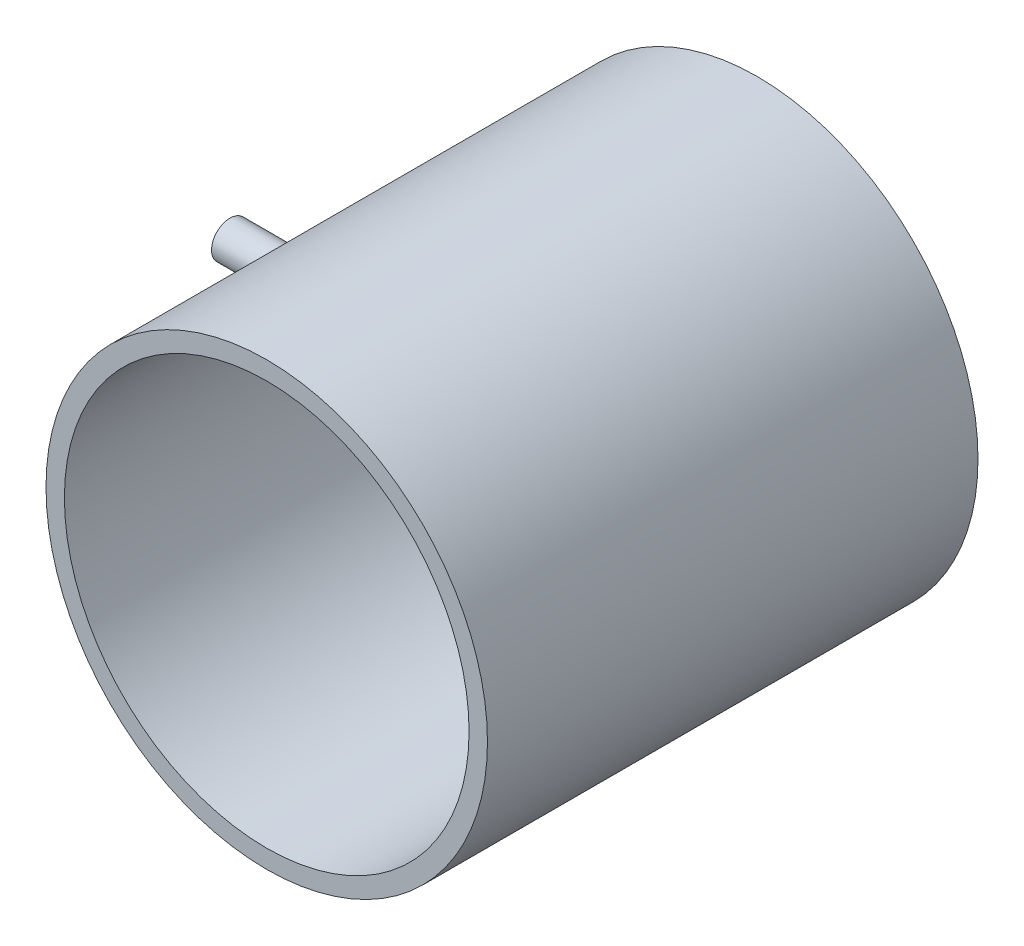
ISO-10303-21;
HEADER;
FILE_DESCRIPTION(('STEP AP214'),'2;1');
FILE_NAME('part.step','',(''),(''),'','','');
FILE_SCHEMA(('AUTOMOTIVE_DESIGN { 1 0 10303 214 1 1 1 1 }'));
ENDSEC;
DATA;
#1=APPLICATION_CONTEXT('core data for automotive mechanical design processes');
#2=APPLICATION_PROTOCOL_DEFINITION('international standard','automotive_design',2000,#1);
#3=PRODUCT_CONTEXT('',#1,'mechanical');
#4=PRODUCT('Part','Part','',(#3));
#5=PRODUCT_RELATED_PRODUCT_CATEGORY('part','',(#4));
#6=PRODUCT_DEFINITION_FORMATION('','',#4);
#7=PRODUCT_DEFINITION_CONTEXT('part definition',#1,'design');
#8=PRODUCT_DEFINITION('design','',#6,#7);
#9=PRODUCT_DEFINITION_SHAPE('','',#8);
#10=(LENGTH_UNIT() NAMED_UNIT(*) SI_UNIT(.MILLI.,.METRE.));
#11=(NAMED_UNIT(*) PLANE_ANGLE_UNIT() SI_UNIT($,.RADIAN.));
#12=(NAMED_UNIT(*) SI_UNIT($,.STERADIAN.) SOLID_ANGLE_UNIT());
#13=UNCERTAINTY_MEASURE_WITH_UNIT(LENGTH_MEASURE(1.E-05),#10,'distance_accuracy_value','');
#14=(GEOMETRIC_REPRESENTATION_CONTEXT(3) GLOBAL_UNCERTAINTY_ASSIGNED_CONTEXT((#13)) GLOBAL_UNIT_ASSIGNED_CONTEXT((#10,
#11,#12)) REPRESENTATION_CONTEXT('',''));
#15=CARTESIAN_POINT('',(0.,0.,0.));
#16=DIRECTION('',(0.,0.,1.));
#17=DIRECTION('',(1.,0.,0.));
#18=AXIS2_PLACEMENT_3D('',#15,#16,#17);
#19=CARTESIAN_POINT('',(-37.1412967530773,71.0530422397824,-40.));
#20=DIRECTION('',(0.,0.,1.));
#21=DIRECTION('',(1.,0.,0.));
#22=AXIS2_PLACEMENT_3D('',#19,#20,#21);
#23=CYLINDRICAL_SURFACE('',#22,18.);
#24=CARTESIAN_POINT('',(-37.1412967530773,71.0530422397824,0.));
#25=DIRECTION('',(0.,0.,1.));
#26=DIRECTION('',(1.,0.,0.));
#27=AXIS2_PLACEMENT_3D('',#24,#25,#26);
#28=CIRCLE('',#27,18.);
#29=CARTESIAN_POINT('',(-19.1412967530773,71.0530422397824,0.));
#30=VERTEX_POINT('',#29);
#31=EDGE_CURVE('E33',#30,#30,#28,.T.);
#32=ORIENTED_EDGE('',*,*,#31,.F.);
#33=EDGE_LOOP('',(#32));
#34=FACE_BOUND('',#33,.T.);
#35=CARTESIAN_POINT('',(-37.1412967530773,71.0530422397824,-40.));
#36=DIRECTION('',(0.,0.,1.));
#37=DIRECTION('',(1.,0.,0.));
#38=AXIS2_PLACEMENT_3D('',#35,#36,#37);
#39=CIRCLE('',#38,18.);
#40=CARTESIAN_POINT('',(-19.1412967530773,71.0530422397824,-40.));
#41=VERTEX_POINT('',#40);
#42=EDGE_CURVE('E10',#41,#41,#39,.T.);
#43=ORIENTED_EDGE('',*,*,#42,.T.);
#44=EDGE_LOOP('',(#43));
#45=FACE_BOUND('',#44,.T.);
#46=CARTESIAN_POINT('',(-55.1412967530773,71.0530422397824,-23.5));
#47=CARTESIAN_POINT('',(-55.1412959342501,70.9689431049006,-23.5000036732394));
#48=CARTESIAN_POINT('',(-55.1407010812283,70.884786719012,-23.5070964547166));
#49=CARTESIAN_POINT('',(-55.1383852880011,70.7188023837318,-23.5352865277826));
#50=CARTESIAN_POINT('',(-55.1366630720527,70.6369771819445,-23.5563996854574));
#51=CARTESIAN_POINT('',(-55.1322871717689,70.478083206011,-23.6120157307141));
#52=CARTESIAN_POINT('',(-55.1296340145546,70.4010117691455,-23.6465110421647));
#53=CARTESIAN_POINT('',(-55.123693769248,70.2537713896583,-23.727898647808));
#54=CARTESIAN_POINT('',(-55.1204068167977,70.1836009749543,-23.7747882902163));
#55=CARTESIAN_POINT('',(-55.113558451078,70.051957239834,-23.879762599909));
#56=CARTESIAN_POINT('',(-55.109996434376,69.9905039311581,-23.9378723259035));
#57=CARTESIAN_POINT('',(-55.1030044651248,69.8782105394775,-24.0635843437749));
#58=CARTESIAN_POINT('',(-55.0995745183829,69.8273709227251,-24.1311870524539));
#59=CARTESIAN_POINT('',(-55.093228542996,69.737680356197,-24.2740871756485));
#60=CARTESIAN_POINT('',(-55.0903132707787,69.6988469903551,-24.3493956631042));
#61=CARTESIAN_POINT('',(-55.0853336198014,69.6343835891216,-24.505492443334));
#62=CARTESIAN_POINT('',(-55.0832692260118,69.6087533205138,-24.5862806392874));
#63=CARTESIAN_POINT('',(-55.0802301340721,69.5714816950545,-24.7508430878218));
#64=CARTESIAN_POINT('',(-55.0792528971206,69.5598077416977,-24.8346099099889));
#65=CARTESIAN_POINT('',(-55.0784907378995,69.5506794277592,-25.002919305918));
#66=CARTESIAN_POINT('',(-55.0787057932532,69.5532248003131,-25.0874618650915));
#67=CARTESIAN_POINT('',(-55.0803016135019,69.5724359434601,-25.2546994982658));
#68=CARTESIAN_POINT('',(-55.0816794537451,69.5890662877253,-25.3373986736146));
#69=CARTESIAN_POINT('',(-55.0854410066178,69.635920261708,-25.4988278010894));
#70=CARTESIAN_POINT('',(-55.0878247290713,69.6661440241872,-25.5775577144408));
#71=CARTESIAN_POINT('',(-55.0933328236801,69.7393665575543,-25.7289263588171));
#72=CARTESIAN_POINT('',(-55.0964581163418,69.7823812226466,-25.8015573663813));
#73=CARTESIAN_POINT('',(-55.1030963560355,69.8799530739123,-25.9385820082297));
#74=CARTESIAN_POINT('',(-55.1066093109178,69.9345104938486,-26.0029754756458));
#75=CARTESIAN_POINT('',(-55.113640059252,70.0538178664428,-26.1219031289223));
#76=CARTESIAN_POINT('',(-55.1171578347033,70.1185984456965,-26.1764065961939));
#77=CARTESIAN_POINT('',(-55.1237916311248,70.2564064052247,-26.2737695850828));
#78=CARTESIAN_POINT('',(-55.1269076518266,70.3294337910094,-26.3166290989203));
#79=CARTESIAN_POINT('',(-55.1323874402219,70.4816823498806,-26.3894856440031));
#80=CARTESIAN_POINT('',(-55.134751128339,70.5609041770687,-26.4194813147172));
#81=CARTESIAN_POINT('',(-55.1384590142543,70.723283636253,-26.465737198677));
#82=CARTESIAN_POINT('',(-55.1398032332106,70.8064411865291,-26.4819976969829));
#83=CARTESIAN_POINT('',(-55.1413180072231,70.974065289536,-26.5002831460624));
#84=CARTESIAN_POINT('',(-55.1414920604573,71.0585271834552,-26.5023505271604));
#85=CARTESIAN_POINT('',(-55.1406562347578,71.2265963685373,-26.492302209059));
#86=CARTESIAN_POINT('',(-55.1396463668674,71.3102036676645,-26.4801866421558));
#87=CARTESIAN_POINT('',(-55.1365585206971,71.4740693741194,-26.4421515120849));
#88=CARTESIAN_POINT('',(-55.1344820643386,71.5543323774919,-26.4162516159613));
#89=CARTESIAN_POINT('',(-55.1294943047626,71.7093734874061,-26.351403118327));
#90=CARTESIAN_POINT('',(-55.1265829883459,71.7841515072071,-26.3124543105123));
#91=CARTESIAN_POINT('',(-55.1202431489818,71.9262930672352,-26.2225069761755));
#92=CARTESIAN_POINT('',(-55.1168134263584,71.9936387655646,-26.1714803404078));
#93=CARTESIAN_POINT('',(-55.1098261326728,72.1188238820478,-26.0588664144243));
#94=CARTESIAN_POINT('',(-55.1062685593902,72.1766631350039,-25.9972789407261));
#95=CARTESIAN_POINT('',(-55.0994161713146,72.281339057965,-25.8651074617025));
#96=CARTESIAN_POINT('',(-55.0961220311907,72.3281480396328,-25.7945014882039));
#97=CARTESIAN_POINT('',(-55.0901790292421,72.4092448340416,-25.6464066057049));
#98=CARTESIAN_POINT('',(-55.0875301609751,72.4435327717973,-25.5689177654351));
#99=CARTESIAN_POINT('',(-55.0831813958114,72.4985670059432,-25.4093548141912));
#100=CARTESIAN_POINT('',(-55.0814803115068,72.5193302519563,-25.3272865829285));
#101=CARTESIAN_POINT('',(-55.0792157384401,72.5467808946476,-25.1608139501884));
#102=CARTESIAN_POINT('',(-55.0786522278318,72.5534685616348,-25.0764095936056));
#103=CARTESIAN_POINT('',(-55.0787269223302,72.5525750841188,-24.9079358109687));
#104=CARTESIAN_POINT('',(-55.0793614634733,72.5450374444485,-24.8238661491454));
#105=CARTESIAN_POINT('',(-55.0817529793119,72.5159980347249,-24.6581911996737));
#106=CARTESIAN_POINT('',(-55.0835099557193,72.4944962433738,-24.5765859157842));
#107=CARTESIAN_POINT('',(-55.0879474100529,72.438149904808,-24.4181533551001));
#108=CARTESIAN_POINT('',(-55.0906278337702,72.4033061407922,-24.3413257981515));
#109=CARTESIAN_POINT('',(-55.0966102512034,72.3212698282033,-24.1946037391395));
#110=CARTESIAN_POINT('',(-55.099912235163,72.2740774734542,-24.12470912828));
#111=CARTESIAN_POINT('',(-55.1067777285575,72.168520152966,-23.9936143914805));
#112=CARTESIAN_POINT('',(-55.1103419731635,72.1101229803946,-23.932440237014));
#113=CARTESIAN_POINT('',(-55.1173236782225,71.9838720781711,-23.820737222195));
#114=CARTESIAN_POINT('',(-55.1207411029497,71.916016063744,-23.770210941256));
#115=CARTESIAN_POINT('',(-55.1270502757114,71.7726428993265,-23.6811702093737));
#116=CARTESIAN_POINT('',(-55.1299410334239,71.6971117241882,-23.6426782920155));
#117=CARTESIAN_POINT('',(-55.1348595408218,71.540685867776,-23.5789722954231));
#118=CARTESIAN_POINT('',(-55.1368882820012,71.4597974729029,-23.5537429535679));
#119=CARTESIAN_POINT('',(-55.1393333690851,71.3242003119274,-23.5237036262469));
#120=CARTESIAN_POINT('',(-55.1400662862316,71.2703635814401,-23.5148265812238));
#121=CARTESIAN_POINT('',(-55.1410482429568,71.1620399970341,-23.5029735854842));
#122=CARTESIAN_POINT('',(-55.1412972838202,71.1075531448419,-23.4999976191003));
#123=CARTESIAN_POINT('',(-55.1412967530773,71.0530422397824,-23.5));
#124=B_SPLINE_CURVE_WITH_KNOTS('',3,(#46,#47,#48,#49,#50,#51,#52,#53,#54,#55,#56,#57,#58,#59,
#60,#61,#62,#63,#64,#65,#66,#67,#68,#69,#70,#71,#72,#73,#74,#75,#76,#77,#78,#79,#80,#81,#82,#83,
#84,#85,#86,#87,#88,#89,#90,#91,#92,#93,#94,#95,#96,#97,#98,#99,#100,#101,#102,#103,#104,#105,
#106,#107,#108,#109,#110,#111,#112,#113,#114,#115,#116,#117,#118,#119,#120,#121,#122,#123),
.UNSPECIFIED.,.T.,.F.,(4,2,2,2,2,2,2,2,2,2,2,2,2,2,2,2,2,2,2,2,2,2,2,2,2,2,2,2,2,2,2,2,2,2,2,2,
2,2,4),(0.,0.252098380200205,0.504482533496747,0.756724010833428,1.00891156437625,
1.26166900317863,1.51443754310896,1.76757454426636,2.02070707391851,2.27324722247378,
2.52578263143927,2.77768474665432,3.02958932215497,3.28180823623348,3.5340322587129,
3.78702676402723,4.04002143837965,4.29304286385674,4.54605903798801,4.79831848960751,
5.0505755882133,5.30247373546177,5.55437586542058,5.8068701246239,6.05936877106874,
6.31249464736801,6.5656179962974,6.8184235086139,7.07122416598135,7.3232529432379,
7.57528210488508,7.82729647421282,8.07930688814782,8.33205282996957,8.58485992848719,
8.83813759593829,9.09112314887675,9.25452729534992,9.41793100798118),.UNSPECIFIED.);
#125=CARTESIAN_POINT('',(-55.1412967530773,71.0530422397824,-23.5));
#126=VERTEX_POINT('',#125);
#127=EDGE_CURVE('E50',#126,#126,#124,.T.);
#128=ORIENTED_EDGE('',*,*,#127,.T.);
#129=EDGE_LOOP('',(#128));
#130=FACE_BOUND('',#129,.T.);
#131=ADVANCED_FACE('F30',(#34,#45,#130),#23,.T.);
#132=CARTESIAN_POINT('',(-37.1412967530773,71.0530422397824,-40.));
#133=DIRECTION('',(0.,0.,1.));
#134=DIRECTION('',(1.,0.,0.));
#135=AXIS2_PLACEMENT_3D('',#132,#133,#134);
#136=PLANE('',#135);
#137=CARTESIAN_POINT('',(-37.1412967530773,71.0530422397824,-40.));
#138=DIRECTION('',(0.,0.,1.));
#139=DIRECTION('',(1.,0.,0.));
#140=AXIS2_PLACEMENT_3D('',#137,#138,#139);
#141=CIRCLE('',#140,16.5);
#142=CARTESIAN_POINT('',(-20.6412967530773,71.0530422397824,-40.));
#143=VERTEX_POINT('',#142);
#144=EDGE_CURVE('E40',#143,#143,#141,.T.);
#145=ORIENTED_EDGE('',*,*,#144,.T.);
#146=EDGE_LOOP('',(#145));
#147=FACE_BOUND('',#146,.T.);
#148=ORIENTED_EDGE('',*,*,#42,.F.);
#149=EDGE_LOOP('',(#148));
#150=FACE_BOUND('',#149,.T.);
#151=ADVANCED_FACE('F72',(#147,#150),#136,.F.);
#152=CARTESIAN_POINT('',(-37.1412967530773,71.0530422397824,0.));
#153=DIRECTION('',(0.,0.,1.));
#154=DIRECTION('',(1.,0.,0.));
#155=AXIS2_PLACEMENT_3D('',#152,#153,#154);
#156=PLANE('',#155);
#157=CARTESIAN_POINT('',(-37.1412967530773,71.0530422397824,0.));
#158=DIRECTION('',(0.,0.,1.));
#159=DIRECTION('',(1.,0.,0.));
#160=AXIS2_PLACEMENT_3D('',#157,#158,#159);
#161=CIRCLE('',#160,16.5);
#162=CARTESIAN_POINT('',(-20.6412967530773,71.0530422397824,0.));
#163=VERTEX_POINT('',#162);
#164=EDGE_CURVE('E42',#163,#163,#161,.T.);
#165=ORIENTED_EDGE('',*,*,#164,.F.);
#166=EDGE_LOOP('',(#165));
#167=FACE_BOUND('',#166,.T.);
#168=ORIENTED_EDGE('',*,*,#31,.T.);
#169=EDGE_LOOP('',(#168));
#170=FACE_BOUND('',#169,.T.);
#171=ADVANCED_FACE('F70',(#167,#170),#156,.T.);
#172=CARTESIAN_POINT('',(-37.1412967530773,71.0530422397824,-40.));
#173=DIRECTION('',(0.,0.,1.));
#174=DIRECTION('',(1.,0.,0.));
#175=AXIS2_PLACEMENT_3D('',#172,#173,#174);
#176=CYLINDRICAL_SURFACE('',#175,16.5);
#177=ORIENTED_EDGE('',*,*,#144,.F.);
#178=EDGE_LOOP('',(#177));
#179=FACE_BOUND('',#178,.T.);
#180=ORIENTED_EDGE('',*,*,#164,.T.);
#181=EDGE_LOOP('',(#180));
#182=FACE_BOUND('',#181,.T.);
#183=ADVANCED_FACE('F66',(#179,#182),#176,.F.);
#184=CARTESIAN_POINT('',(-65.1412967530773,71.0530422397824,-25.));
#185=DIRECTION('',(1.,0.,0.));
#186=DIRECTION('',(0.,0.,-1.));
#187=AXIS2_PLACEMENT_3D('',#184,#185,#186);
#188=CYLINDRICAL_SURFACE('',#187,1.5);
#189=CARTESIAN_POINT('',(-65.1412967530773,71.0530422397824,-25.));
#190=DIRECTION('',(-1.,0.,0.));
#191=DIRECTION('',(0.,0.,1.));
#192=AXIS2_PLACEMENT_3D('',#189,#190,#191);
#193=CIRCLE('',#192,1.5);
#194=CARTESIAN_POINT('',(-65.1412967530773,71.0530422397824,-23.5));
#195=VERTEX_POINT('',#194);
#196=EDGE_CURVE('E45',#195,#195,#193,.T.);
#197=ORIENTED_EDGE('',*,*,#196,.F.);
#198=EDGE_LOOP('',(#197));
#199=FACE_BOUND('',#198,.T.);
#200=ORIENTED_EDGE('',*,*,#127,.F.);
#201=EDGE_LOOP('',(#200));
#202=FACE_BOUND('',#201,.T.);
#203=ADVANCED_FACE('F62',(#199,#202),#188,.T.);
#204=CARTESIAN_POINT('',(-65.1412967530773,71.0530422397824,-25.));
#205=DIRECTION('',(-1.,0.,0.));
#206=DIRECTION('',(0.,0.,1.));
#207=AXIS2_PLACEMENT_3D('',#204,#205,#206);
#208=PLANE('',#207);
#209=ORIENTED_EDGE('',*,*,#196,.T.);
#210=EDGE_LOOP('',(#209));
#211=FACE_BOUND('',#210,.T.);
#212=ADVANCED_FACE('F59',(#211),#208,.T.);
#213=CLOSED_SHELL('',(#131,#151,#171,#183,#203,#212));
#214=MANIFOLD_SOLID_BREP('B2',#213);
#215=ADVANCED_BREP_SHAPE_REPRESENTATION('',(#18,#214),#14);
#216=SHAPE_DEFINITION_REPRESENTATION(#9,#215);
ENDSEC;
END-ISO-10303-21;
